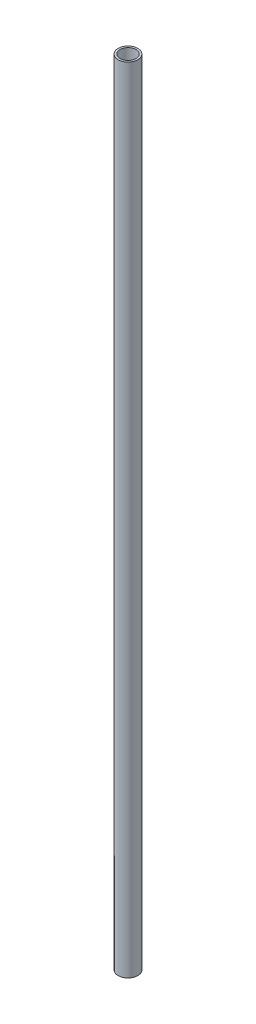
ISO-10303-21;
HEADER;
FILE_DESCRIPTION(('STEP AP214'),'2;1');
FILE_NAME('part.step','',(''),(''),'','','');
FILE_SCHEMA(('AUTOMOTIVE_DESIGN { 1 0 10303 214 1 1 1 1 }'));
ENDSEC;
DATA;
#1=APPLICATION_CONTEXT('core data for automotive mechanical design processes');
#2=APPLICATION_PROTOCOL_DEFINITION('international standard','automotive_design',2000,#1);
#3=PRODUCT_CONTEXT('',#1,'mechanical');
#4=PRODUCT('Part','Part','',(#3));
#5=PRODUCT_RELATED_PRODUCT_CATEGORY('part','',(#4));
#6=PRODUCT_DEFINITION_FORMATION('','',#4);
#7=PRODUCT_DEFINITION_CONTEXT('part definition',#1,'design');
#8=PRODUCT_DEFINITION('design','',#6,#7);
#9=PRODUCT_DEFINITION_SHAPE('','',#8);
#10=(LENGTH_UNIT() NAMED_UNIT(*) SI_UNIT(.MILLI.,.METRE.));
#11=(NAMED_UNIT(*) PLANE_ANGLE_UNIT() SI_UNIT($,.RADIAN.));
#12=(NAMED_UNIT(*) SI_UNIT($,.STERADIAN.) SOLID_ANGLE_UNIT());
#13=UNCERTAINTY_MEASURE_WITH_UNIT(LENGTH_MEASURE(1.E-05),#10,'distance_accuracy_value','');
#14=(GEOMETRIC_REPRESENTATION_CONTEXT(3) GLOBAL_UNCERTAINTY_ASSIGNED_CONTEXT((#13)) GLOBAL_UNIT_ASSIGNED_CONTEXT((#10,
#11,#12)) REPRESENTATION_CONTEXT('',''));
#15=CARTESIAN_POINT('',(0.,0.,0.));
#16=DIRECTION('',(0.,0.,1.));
#17=DIRECTION('',(1.,0.,0.));
#18=AXIS2_PLACEMENT_3D('',#15,#16,#17);
#19=CARTESIAN_POINT('',(0.,25.,0.));
#20=DIRECTION('',(0.,1.,0.));
#21=DIRECTION('',(0.,0.,1.));
#22=AXIS2_PLACEMENT_3D('',#19,#20,#21);
#23=PLANE('',#22);
#24=CARTESIAN_POINT('',(0.,25.,0.));
#25=DIRECTION('',(0.,1.,0.));
#26=DIRECTION('',(0.,0.,1.));
#27=AXIS2_PLACEMENT_3D('',#24,#25,#26);
#28=CIRCLE('',#27,0.310000000000001);
#29=CARTESIAN_POINT('',(0.,25.,0.310000000000001));
#30=VERTEX_POINT('',#29);
#31=EDGE_CURVE('E10',#30,#30,#28,.T.);
#32=ORIENTED_EDGE('',*,*,#31,.T.);
#33=EDGE_LOOP('',(#32));
#34=FACE_BOUND('',#33,.T.);
#35=CARTESIAN_POINT('',(0.,25.,0.));
#36=DIRECTION('',(0.,1.,0.));
#37=DIRECTION('',(0.,0.,1.));
#38=AXIS2_PLACEMENT_3D('',#35,#36,#37);
#39=CIRCLE('',#38,0.25);
#40=CARTESIAN_POINT('',(0.,25.,0.25));
#41=VERTEX_POINT('',#40);
#42=EDGE_CURVE('E41',#41,#41,#39,.T.);
#43=ORIENTED_EDGE('',*,*,#42,.F.);
#44=EDGE_LOOP('',(#43));
#45=FACE_BOUND('',#44,.T.);
#46=ADVANCED_FACE('F30',(#34,#45),#23,.T.);
#47=CARTESIAN_POINT('',(0.,0.,0.));
#48=DIRECTION('',(0.,1.,0.));
#49=DIRECTION('',(0.,0.,1.));
#50=AXIS2_PLACEMENT_3D('',#47,#48,#49);
#51=PLANE('',#50);
#52=CARTESIAN_POINT('',(0.,0.,0.));
#53=DIRECTION('',(0.,1.,0.));
#54=DIRECTION('',(0.,0.,1.));
#55=AXIS2_PLACEMENT_3D('',#52,#53,#54);
#56=CIRCLE('',#55,0.310000000000001);
#57=CARTESIAN_POINT('',(0.,0.,0.310000000000001));
#58=VERTEX_POINT('',#57);
#59=EDGE_CURVE('E34',#58,#58,#56,.T.);
#60=ORIENTED_EDGE('',*,*,#59,.F.);
#61=EDGE_LOOP('',(#60));
#62=FACE_BOUND('',#61,.T.);
#63=CARTESIAN_POINT('',(0.,0.,0.));
#64=DIRECTION('',(0.,1.,0.));
#65=DIRECTION('',(0.,0.,1.));
#66=AXIS2_PLACEMENT_3D('',#63,#64,#65);
#67=CIRCLE('',#66,0.25);
#68=CARTESIAN_POINT('',(0.,0.,0.25));
#69=VERTEX_POINT('',#68);
#70=EDGE_CURVE('E43',#69,#69,#67,.T.);
#71=ORIENTED_EDGE('',*,*,#70,.T.);
#72=EDGE_LOOP('',(#71));
#73=FACE_BOUND('',#72,.T.);
#74=ADVANCED_FACE('F53',(#62,#73),#51,.F.);
#75=CARTESIAN_POINT('',(0.,25.,0.));
#76=DIRECTION('',(0.,-1.,0.));
#77=DIRECTION('',(0.,0.,-1.));
#78=AXIS2_PLACEMENT_3D('',#75,#76,#77);
#79=CYLINDRICAL_SURFACE('',#78,0.310000000000001);
#80=ORIENTED_EDGE('',*,*,#31,.F.);
#81=EDGE_LOOP('',(#80));
#82=FACE_BOUND('',#81,.T.);
#83=ORIENTED_EDGE('',*,*,#59,.T.);
#84=EDGE_LOOP('',(#83));
#85=FACE_BOUND('',#84,.T.);
#86=ADVANCED_FACE('F32',(#82,#85),#79,.T.);
#87=CARTESIAN_POINT('',(0.,25.,0.));
#88=DIRECTION('',(0.,-1.,0.));
#89=DIRECTION('',(0.,0.,-1.));
#90=AXIS2_PLACEMENT_3D('',#87,#88,#89);
#91=CYLINDRICAL_SURFACE('',#90,0.25);
#92=ORIENTED_EDGE('',*,*,#42,.T.);
#93=EDGE_LOOP('',(#92));
#94=FACE_BOUND('',#93,.T.);
#95=ORIENTED_EDGE('',*,*,#70,.F.);
#96=EDGE_LOOP('',(#95));
#97=FACE_BOUND('',#96,.T.);
#98=ADVANCED_FACE('F49',(#94,#97),#91,.F.);
#99=CLOSED_SHELL('',(#46,#74,#86,#98));
#100=MANIFOLD_SOLID_BREP('B2',#99);
#101=ADVANCED_BREP_SHAPE_REPRESENTATION('',(#18,#100),#14);
#102=SHAPE_DEFINITION_REPRESENTATION(#9,#101);
ENDSEC;
END-ISO-10303-21;
